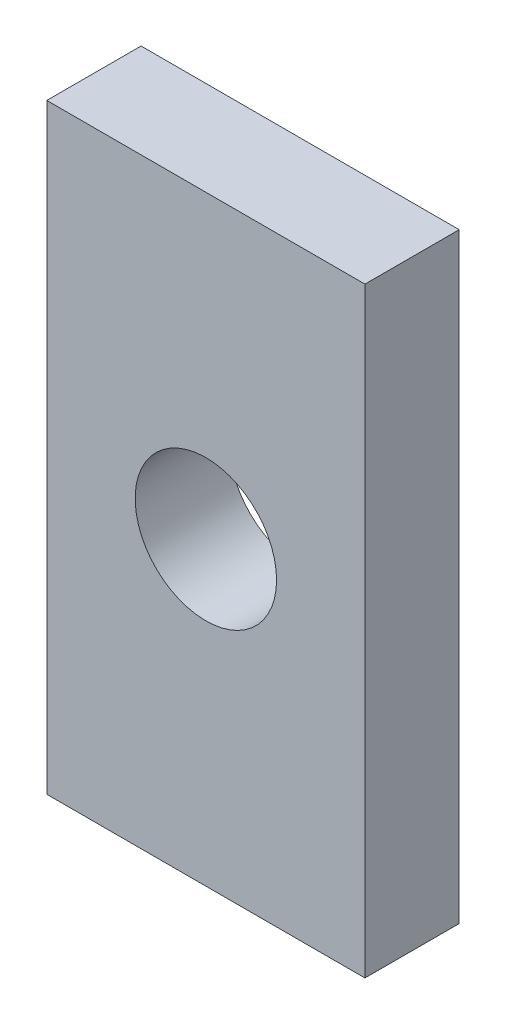
ISO-10303-21;
HEADER;
FILE_DESCRIPTION(('STEP AP214'),'2;1');
FILE_NAME('part.step','',(''),(''),'','','');
FILE_SCHEMA(('AUTOMOTIVE_DESIGN { 1 0 10303 214 1 1 1 1 }'));
ENDSEC;
DATA;
#1=APPLICATION_CONTEXT('core data for automotive mechanical design processes');
#2=APPLICATION_PROTOCOL_DEFINITION('international standard','automotive_design',2000,#1);
#3=PRODUCT_CONTEXT('',#1,'mechanical');
#4=PRODUCT('Part','Part','',(#3));
#5=PRODUCT_RELATED_PRODUCT_CATEGORY('part','',(#4));
#6=PRODUCT_DEFINITION_FORMATION('','',#4);
#7=PRODUCT_DEFINITION_CONTEXT('part definition',#1,'design');
#8=PRODUCT_DEFINITION('design','',#6,#7);
#9=PRODUCT_DEFINITION_SHAPE('','',#8);
#10=(LENGTH_UNIT() NAMED_UNIT(*) SI_UNIT(.MILLI.,.METRE.));
#11=(NAMED_UNIT(*) PLANE_ANGLE_UNIT() SI_UNIT($,.RADIAN.));
#12=(NAMED_UNIT(*) SI_UNIT($,.STERADIAN.) SOLID_ANGLE_UNIT());
#13=UNCERTAINTY_MEASURE_WITH_UNIT(LENGTH_MEASURE(1.E-05),#10,'distance_accuracy_value','');
#14=(GEOMETRIC_REPRESENTATION_CONTEXT(3) GLOBAL_UNCERTAINTY_ASSIGNED_CONTEXT((#13)) GLOBAL_UNIT_ASSIGNED_CONTEXT((#10,
#11,#12)) REPRESENTATION_CONTEXT('',''));
#15=CARTESIAN_POINT('',(0.,0.,0.));
#16=DIRECTION('',(0.,0.,1.));
#17=DIRECTION('',(1.,0.,0.));
#18=AXIS2_PLACEMENT_3D('',#15,#16,#17);
#19=CARTESIAN_POINT('',(20.25,38.25,12.));
#20=DIRECTION('',(-1.,0.,0.));
#21=DIRECTION('',(0.,-1.,0.));
#22=AXIS2_PLACEMENT_3D('',#19,#20,#21);
#23=PLANE('',#22);
#24=DIRECTION('',(0.,1.,0.));
#25=VECTOR('',#24,1.);
#26=CARTESIAN_POINT('',(20.25,38.25,0.));
#27=LINE('',#26,#25);
#28=CARTESIAN_POINT('',(20.25,-38.25,0.));
#29=VERTEX_POINT('',#28);
#30=CARTESIAN_POINT('',(20.25,38.25,0.));
#31=VERTEX_POINT('',#30);
#32=EDGE_CURVE('E105',#29,#31,#27,.T.);
#33=ORIENTED_EDGE('',*,*,#32,.T.);
#34=DIRECTION('',(0.,0.,-1.));
#35=VECTOR('',#34,1.);
#36=CARTESIAN_POINT('',(20.25,38.25,12.));
#37=LINE('',#36,#35);
#38=CARTESIAN_POINT('',(20.25,38.25,12.));
#39=VERTEX_POINT('',#38);
#40=EDGE_CURVE('E11',#39,#31,#37,.T.);
#41=ORIENTED_EDGE('',*,*,#40,.F.);
#42=DIRECTION('',(0.,1.,0.));
#43=VECTOR('',#42,1.);
#44=CARTESIAN_POINT('',(20.25,38.25,12.));
#45=LINE('',#44,#43);
#46=CARTESIAN_POINT('',(20.25,-38.25,12.));
#47=VERTEX_POINT('',#46);
#48=EDGE_CURVE('E93',#47,#39,#45,.T.);
#49=ORIENTED_EDGE('',*,*,#48,.F.);
#50=DIRECTION('',(0.,0.,-1.));
#51=VECTOR('',#50,1.);
#52=CARTESIAN_POINT('',(20.25,-38.25,12.));
#53=LINE('',#52,#51);
#54=EDGE_CURVE('E101',#47,#29,#53,.T.);
#55=ORIENTED_EDGE('',*,*,#54,.T.);
#56=EDGE_LOOP('',(#33,#41,#49,#55));
#57=FACE_BOUND('',#56,.T.);
#58=ADVANCED_FACE('F42',(#57),#23,.F.);
#59=CARTESIAN_POINT('',(-20.25,38.25,12.));
#60=DIRECTION('',(0.,-1.,0.));
#61=DIRECTION('',(0.,0.,-1.));
#62=AXIS2_PLACEMENT_3D('',#59,#60,#61);
#63=PLANE('',#62);
#64=DIRECTION('',(-1.,0.,0.));
#65=VECTOR('',#64,1.);
#66=CARTESIAN_POINT('',(-20.25,38.25,0.));
#67=LINE('',#66,#65);
#68=CARTESIAN_POINT('',(-20.25,38.25,0.));
#69=VERTEX_POINT('',#68);
#70=EDGE_CURVE('E97',#31,#69,#67,.T.);
#71=ORIENTED_EDGE('',*,*,#70,.T.);
#72=DIRECTION('',(0.,0.,-1.));
#73=VECTOR('',#72,1.);
#74=CARTESIAN_POINT('',(-20.25,38.25,12.));
#75=LINE('',#74,#73);
#76=CARTESIAN_POINT('',(-20.25,38.25,12.));
#77=VERTEX_POINT('',#76);
#78=EDGE_CURVE('E50',#77,#69,#75,.T.);
#79=ORIENTED_EDGE('',*,*,#78,.F.);
#80=DIRECTION('',(-1.,0.,0.));
#81=VECTOR('',#80,1.);
#82=CARTESIAN_POINT('',(-20.25,38.25,12.));
#83=LINE('',#82,#81);
#84=EDGE_CURVE('E88',#39,#77,#83,.T.);
#85=ORIENTED_EDGE('',*,*,#84,.F.);
#86=ORIENTED_EDGE('',*,*,#40,.T.);
#87=EDGE_LOOP('',(#71,#79,#85,#86));
#88=FACE_BOUND('',#87,.T.);
#89=ADVANCED_FACE('F96',(#88),#63,.F.);
#90=CARTESIAN_POINT('',(-20.25,38.25,12.));
#91=DIRECTION('',(1.,0.,0.));
#92=DIRECTION('',(0.,1.,0.));
#93=AXIS2_PLACEMENT_3D('',#90,#91,#92);
#94=PLANE('',#93);
#95=DIRECTION('',(0.,-1.,0.));
#96=VECTOR('',#95,1.);
#97=CARTESIAN_POINT('',(-20.25,38.25,0.));
#98=LINE('',#97,#96);
#99=CARTESIAN_POINT('',(-20.25,-38.25,0.));
#100=VERTEX_POINT('',#99);
#101=EDGE_CURVE('E75',#69,#100,#98,.T.);
#102=ORIENTED_EDGE('',*,*,#101,.T.);
#103=DIRECTION('',(0.,0.,-1.));
#104=VECTOR('',#103,1.);
#105=CARTESIAN_POINT('',(-20.25,-38.25,12.));
#106=LINE('',#105,#104);
#107=CARTESIAN_POINT('',(-20.25,-38.25,12.));
#108=VERTEX_POINT('',#107);
#109=EDGE_CURVE('E98',#108,#100,#106,.T.);
#110=ORIENTED_EDGE('',*,*,#109,.F.);
#111=DIRECTION('',(0.,-1.,0.));
#112=VECTOR('',#111,1.);
#113=CARTESIAN_POINT('',(-20.25,38.25,12.));
#114=LINE('',#113,#112);
#115=EDGE_CURVE('E91',#77,#108,#114,.T.);
#116=ORIENTED_EDGE('',*,*,#115,.F.);
#117=ORIENTED_EDGE('',*,*,#78,.T.);
#118=EDGE_LOOP('',(#102,#110,#116,#117));
#119=FACE_BOUND('',#118,.T.);
#120=ADVANCED_FACE('F99',(#119),#94,.F.);
#121=CARTESIAN_POINT('',(-20.25,-38.25,12.));
#122=DIRECTION('',(0.,1.,0.));
#123=DIRECTION('',(0.,0.,1.));
#124=AXIS2_PLACEMENT_3D('',#121,#122,#123);
#125=PLANE('',#124);
#126=DIRECTION('',(1.,0.,0.));
#127=VECTOR('',#126,1.);
#128=CARTESIAN_POINT('',(-20.25,-38.25,0.));
#129=LINE('',#128,#127);
#130=EDGE_CURVE('E81',#100,#29,#129,.T.);
#131=ORIENTED_EDGE('',*,*,#130,.T.);
#132=ORIENTED_EDGE('',*,*,#54,.F.);
#133=DIRECTION('',(1.,0.,0.));
#134=VECTOR('',#133,1.);
#135=CARTESIAN_POINT('',(-20.25,-38.25,12.));
#136=LINE('',#135,#134);
#137=EDGE_CURVE('E58',#108,#47,#136,.T.);
#138=ORIENTED_EDGE('',*,*,#137,.F.);
#139=ORIENTED_EDGE('',*,*,#109,.T.);
#140=EDGE_LOOP('',(#131,#132,#138,#139));
#141=FACE_BOUND('',#140,.T.);
#142=ADVANCED_FACE('F113',(#141),#125,.F.);
#143=CARTESIAN_POINT('',(0.,0.,12.));
#144=DIRECTION('',(0.,0.,1.));
#145=DIRECTION('',(1.,0.,0.));
#146=AXIS2_PLACEMENT_3D('',#143,#144,#145);
#147=PLANE('',#146);
#148=CARTESIAN_POINT('',(0.,0.,12.));
#149=DIRECTION('',(0.,0.,1.));
#150=DIRECTION('',(1.,0.,0.));
#151=AXIS2_PLACEMENT_3D('',#148,#149,#150);
#152=CIRCLE('',#151,9.);
#153=CARTESIAN_POINT('',(9.,0.,12.));
#154=VERTEX_POINT('',#153);
#155=EDGE_CURVE('E121',#154,#154,#152,.T.);
#156=ORIENTED_EDGE('',*,*,#155,.F.);
#157=EDGE_LOOP('',(#156));
#158=FACE_BOUND('',#157,.T.);
#159=ORIENTED_EDGE('',*,*,#48,.T.);
#160=ORIENTED_EDGE('',*,*,#84,.T.);
#161=ORIENTED_EDGE('',*,*,#115,.T.);
#162=ORIENTED_EDGE('',*,*,#137,.T.);
#163=EDGE_LOOP('',(#159,#160,#161,#162));
#164=FACE_BOUND('',#163,.T.);
#165=ADVANCED_FACE('F89',(#158,#164),#147,.T.);
#166=CARTESIAN_POINT('',(0.,0.,0.));
#167=DIRECTION('',(0.,0.,1.));
#168=DIRECTION('',(1.,0.,0.));
#169=AXIS2_PLACEMENT_3D('',#166,#167,#168);
#170=PLANE('',#169);
#171=CARTESIAN_POINT('',(0.,0.,0.));
#172=DIRECTION('',(0.,0.,1.));
#173=DIRECTION('',(1.,0.,0.));
#174=AXIS2_PLACEMENT_3D('',#171,#172,#173);
#175=CIRCLE('',#174,9.);
#176=CARTESIAN_POINT('',(9.,0.,0.));
#177=VERTEX_POINT('',#176);
#178=EDGE_CURVE('E108',#177,#177,#175,.F.);
#179=ORIENTED_EDGE('',*,*,#178,.F.);
#180=EDGE_LOOP('',(#179));
#181=FACE_BOUND('',#180,.T.);
#182=ORIENTED_EDGE('',*,*,#32,.F.);
#183=ORIENTED_EDGE('',*,*,#130,.F.);
#184=ORIENTED_EDGE('',*,*,#101,.F.);
#185=ORIENTED_EDGE('',*,*,#70,.F.);
#186=EDGE_LOOP('',(#182,#183,#184,#185));
#187=FACE_BOUND('',#186,.T.);
#188=ADVANCED_FACE('F116',(#181,#187),#170,.F.);
#189=CARTESIAN_POINT('',(0.,0.,-0.000999999999999265));
#190=DIRECTION('',(0.,0.,1.));
#191=DIRECTION('',(1.,0.,0.));
#192=AXIS2_PLACEMENT_3D('',#189,#190,#191);
#193=CYLINDRICAL_SURFACE('',#192,9.);
#194=ORIENTED_EDGE('',*,*,#155,.T.);
#195=EDGE_LOOP('',(#194));
#196=FACE_BOUND('',#195,.T.);
#197=ORIENTED_EDGE('',*,*,#178,.T.);
#198=EDGE_LOOP('',(#197));
#199=FACE_BOUND('',#198,.T.);
#200=ADVANCED_FACE('F125',(#196,#199),#193,.F.);
#201=CLOSED_SHELL('',(#58,#89,#120,#142,#165,#188,#200));
#202=MANIFOLD_SOLID_BREP('B2',#201);
#203=ADVANCED_BREP_SHAPE_REPRESENTATION('',(#18,#202),#14);
#204=SHAPE_DEFINITION_REPRESENTATION(#9,#203);
ENDSEC;
END-ISO-10303-21;
